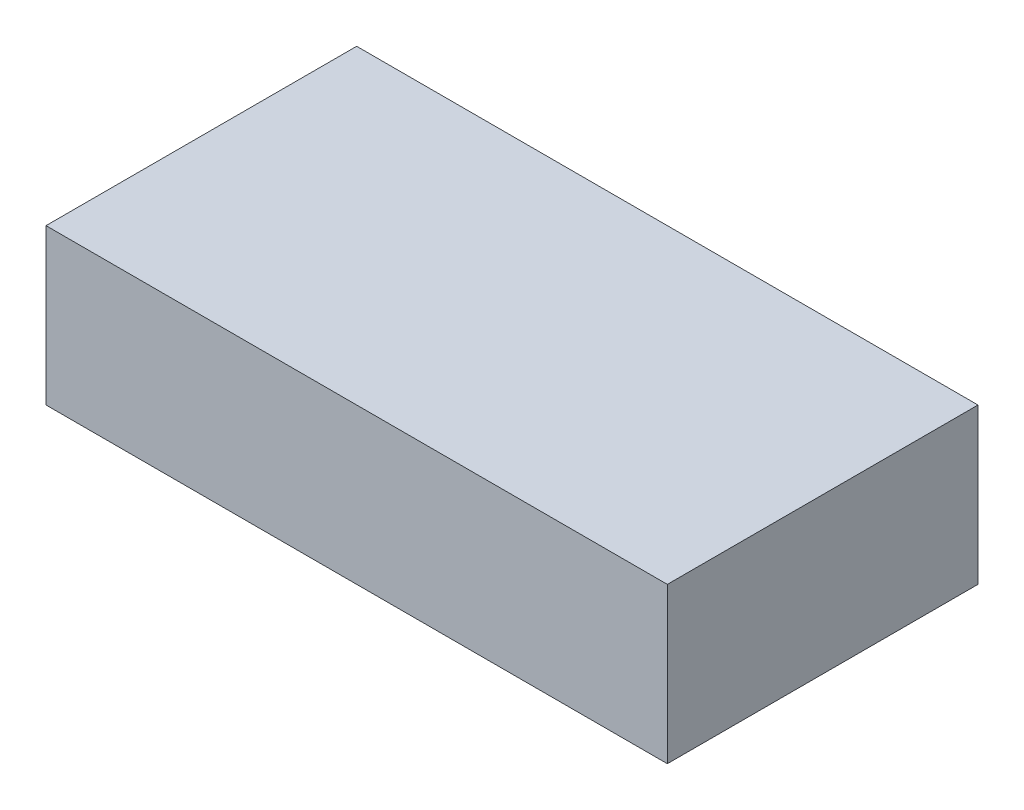
ISO-10303-21;
HEADER;
FILE_DESCRIPTION(('STEP AP214'),'2;1');
FILE_NAME('part.step','',(''),(''),'','','');
FILE_SCHEMA(('AUTOMOTIVE_DESIGN { 1 0 10303 214 1 1 1 1 }'));
ENDSEC;
DATA;
#1=APPLICATION_CONTEXT('core data for automotive mechanical design processes');
#2=APPLICATION_PROTOCOL_DEFINITION('international standard','automotive_design',2000,#1);
#3=PRODUCT_CONTEXT('',#1,'mechanical');
#4=PRODUCT('Part','Part','',(#3));
#5=PRODUCT_RELATED_PRODUCT_CATEGORY('part','',(#4));
#6=PRODUCT_DEFINITION_FORMATION('','',#4);
#7=PRODUCT_DEFINITION_CONTEXT('part definition',#1,'design');
#8=PRODUCT_DEFINITION('design','',#6,#7);
#9=PRODUCT_DEFINITION_SHAPE('','',#8);
#10=(LENGTH_UNIT() NAMED_UNIT(*) SI_UNIT(.MILLI.,.METRE.));
#11=(NAMED_UNIT(*) PLANE_ANGLE_UNIT() SI_UNIT($,.RADIAN.));
#12=(NAMED_UNIT(*) SI_UNIT($,.STERADIAN.) SOLID_ANGLE_UNIT());
#13=UNCERTAINTY_MEASURE_WITH_UNIT(LENGTH_MEASURE(1.E-05),#10,'distance_accuracy_value','');
#14=(GEOMETRIC_REPRESENTATION_CONTEXT(3) GLOBAL_UNCERTAINTY_ASSIGNED_CONTEXT((#13)) GLOBAL_UNIT_ASSIGNED_CONTEXT((#10,
#11,#12)) REPRESENTATION_CONTEXT('',''));
#15=CARTESIAN_POINT('',(0.,0.,0.));
#16=DIRECTION('',(0.,0.,1.));
#17=DIRECTION('',(1.,0.,0.));
#18=AXIS2_PLACEMENT_3D('',#15,#16,#17);
#19=CARTESIAN_POINT('',(0.,0.5,0.));
#20=DIRECTION('',(1.,0.,0.));
#21=DIRECTION('',(0.,0.,-1.));
#22=AXIS2_PLACEMENT_3D('',#19,#20,#21);
#23=PLANE('',#22);
#24=DIRECTION('',(0.,0.,1.));
#25=VECTOR('',#24,1.);
#26=CARTESIAN_POINT('',(0.,0.,0.));
#27=LINE('',#26,#25);
#28=CARTESIAN_POINT('',(0.,0.,-1.));
#29=VERTEX_POINT('',#28);
#30=CARTESIAN_POINT('',(0.,0.,0.));
#31=VERTEX_POINT('',#30);
#32=EDGE_CURVE('E75',#29,#31,#27,.T.);
#33=ORIENTED_EDGE('',*,*,#32,.T.);
#34=DIRECTION('',(0.,-1.,0.));
#35=VECTOR('',#34,1.);
#36=CARTESIAN_POINT('',(0.,0.5,0.));
#37=LINE('',#36,#35);
#38=CARTESIAN_POINT('',(0.,0.5,0.));
#39=VERTEX_POINT('',#38);
#40=EDGE_CURVE('E11',#39,#31,#37,.T.);
#41=ORIENTED_EDGE('',*,*,#40,.F.);
#42=DIRECTION('',(0.,0.,1.));
#43=VECTOR('',#42,1.);
#44=CARTESIAN_POINT('',(0.,0.5,0.));
#45=LINE('',#44,#43);
#46=CARTESIAN_POINT('',(0.,0.5,-1.));
#47=VERTEX_POINT('',#46);
#48=EDGE_CURVE('E93',#47,#39,#45,.T.);
#49=ORIENTED_EDGE('',*,*,#48,.F.);
#50=DIRECTION('',(0.,-1.,0.));
#51=VECTOR('',#50,1.);
#52=CARTESIAN_POINT('',(0.,0.5,-1.));
#53=LINE('',#52,#51);
#54=EDGE_CURVE('E87',#47,#29,#53,.T.);
#55=ORIENTED_EDGE('',*,*,#54,.T.);
#56=EDGE_LOOP('',(#33,#41,#49,#55));
#57=FACE_BOUND('',#56,.T.);
#58=ADVANCED_FACE('F31',(#57),#23,.F.);
#59=CARTESIAN_POINT('',(0.,0.5,0.));
#60=DIRECTION('',(0.,0.,-1.));
#61=DIRECTION('',(-1.,0.,0.));
#62=AXIS2_PLACEMENT_3D('',#59,#60,#61);
#63=PLANE('',#62);
#64=DIRECTION('',(1.,0.,0.));
#65=VECTOR('',#64,1.);
#66=CARTESIAN_POINT('',(0.,0.,0.));
#67=LINE('',#66,#65);
#68=CARTESIAN_POINT('',(2.,0.,0.));
#69=VERTEX_POINT('',#68);
#70=EDGE_CURVE('E71',#31,#69,#67,.T.);
#71=ORIENTED_EDGE('',*,*,#70,.T.);
#72=DIRECTION('',(0.,-1.,0.));
#73=VECTOR('',#72,1.);
#74=CARTESIAN_POINT('',(2.,0.5,0.));
#75=LINE('',#74,#73);
#76=CARTESIAN_POINT('',(2.,0.5,0.));
#77=VERTEX_POINT('',#76);
#78=EDGE_CURVE('E38',#77,#69,#75,.T.);
#79=ORIENTED_EDGE('',*,*,#78,.F.);
#80=DIRECTION('',(1.,0.,0.));
#81=VECTOR('',#80,1.);
#82=CARTESIAN_POINT('',(0.,0.5,0.));
#83=LINE('',#82,#81);
#84=EDGE_CURVE('E83',#39,#77,#83,.T.);
#85=ORIENTED_EDGE('',*,*,#84,.F.);
#86=ORIENTED_EDGE('',*,*,#40,.T.);
#87=EDGE_LOOP('',(#71,#79,#85,#86));
#88=FACE_BOUND('',#87,.T.);
#89=ADVANCED_FACE('F82',(#88),#63,.F.);
#90=CARTESIAN_POINT('',(2.,0.5,0.));
#91=DIRECTION('',(-1.,0.,0.));
#92=DIRECTION('',(0.,0.,1.));
#93=AXIS2_PLACEMENT_3D('',#90,#91,#92);
#94=PLANE('',#93);
#95=DIRECTION('',(0.,0.,-1.));
#96=VECTOR('',#95,1.);
#97=CARTESIAN_POINT('',(2.,0.,0.));
#98=LINE('',#97,#96);
#99=CARTESIAN_POINT('',(2.,0.,-1.));
#100=VERTEX_POINT('',#99);
#101=EDGE_CURVE('E76',#69,#100,#98,.T.);
#102=ORIENTED_EDGE('',*,*,#101,.T.);
#103=DIRECTION('',(0.,-1.,0.));
#104=VECTOR('',#103,1.);
#105=CARTESIAN_POINT('',(2.,0.5,-1.));
#106=LINE('',#105,#104);
#107=CARTESIAN_POINT('',(2.,0.5,-1.));
#108=VERTEX_POINT('',#107);
#109=EDGE_CURVE('E99',#108,#100,#106,.T.);
#110=ORIENTED_EDGE('',*,*,#109,.F.);
#111=DIRECTION('',(0.,0.,-1.));
#112=VECTOR('',#111,1.);
#113=CARTESIAN_POINT('',(2.,0.5,0.));
#114=LINE('',#113,#112);
#115=EDGE_CURVE('E50',#77,#108,#114,.T.);
#116=ORIENTED_EDGE('',*,*,#115,.F.);
#117=ORIENTED_EDGE('',*,*,#78,.T.);
#118=EDGE_LOOP('',(#102,#110,#116,#117));
#119=FACE_BOUND('',#118,.T.);
#120=ADVANCED_FACE('F102',(#119),#94,.F.);
#121=CARTESIAN_POINT('',(0.,0.5,-1.));
#122=DIRECTION('',(0.,0.,1.));
#123=DIRECTION('',(1.,0.,0.));
#124=AXIS2_PLACEMENT_3D('',#121,#122,#123);
#125=PLANE('',#124);
#126=DIRECTION('',(-1.,0.,0.));
#127=VECTOR('',#126,1.);
#128=CARTESIAN_POINT('',(0.,0.,-1.));
#129=LINE('',#128,#127);
#130=EDGE_CURVE('E91',#100,#29,#129,.T.);
#131=ORIENTED_EDGE('',*,*,#130,.T.);
#132=ORIENTED_EDGE('',*,*,#54,.F.);
#133=DIRECTION('',(-1.,0.,0.));
#134=VECTOR('',#133,1.);
#135=CARTESIAN_POINT('',(0.,0.5,-1.));
#136=LINE('',#135,#134);
#137=EDGE_CURVE('E45',#108,#47,#136,.T.);
#138=ORIENTED_EDGE('',*,*,#137,.F.);
#139=ORIENTED_EDGE('',*,*,#109,.T.);
#140=EDGE_LOOP('',(#131,#132,#138,#139));
#141=FACE_BOUND('',#140,.T.);
#142=ADVANCED_FACE('F104',(#141),#125,.F.);
#143=CARTESIAN_POINT('',(0.,0.5,-1.));
#144=DIRECTION('',(0.,-1.,0.));
#145=DIRECTION('',(0.,0.,-1.));
#146=AXIS2_PLACEMENT_3D('',#143,#144,#145);
#147=PLANE('',#146);
#148=ORIENTED_EDGE('',*,*,#48,.T.);
#149=ORIENTED_EDGE('',*,*,#84,.T.);
#150=ORIENTED_EDGE('',*,*,#115,.T.);
#151=ORIENTED_EDGE('',*,*,#137,.T.);
#152=EDGE_LOOP('',(#148,#149,#150,#151));
#153=FACE_BOUND('',#152,.T.);
#154=ADVANCED_FACE('F105',(#153),#147,.F.);
#155=CARTESIAN_POINT('',(0.,0.,-1.));
#156=DIRECTION('',(0.,-1.,0.));
#157=DIRECTION('',(0.,0.,-1.));
#158=AXIS2_PLACEMENT_3D('',#155,#156,#157);
#159=PLANE('',#158);
#160=ORIENTED_EDGE('',*,*,#32,.F.);
#161=ORIENTED_EDGE('',*,*,#130,.F.);
#162=ORIENTED_EDGE('',*,*,#101,.F.);
#163=ORIENTED_EDGE('',*,*,#70,.F.);
#164=EDGE_LOOP('',(#160,#161,#162,#163));
#165=FACE_BOUND('',#164,.T.);
#166=ADVANCED_FACE('F72',(#165),#159,.T.);
#167=CLOSED_SHELL('',(#58,#89,#120,#142,#154,#166));
#168=MANIFOLD_SOLID_BREP('B2',#167);
#169=ADVANCED_BREP_SHAPE_REPRESENTATION('',(#18,#168),#14);
#170=SHAPE_DEFINITION_REPRESENTATION(#9,#169);
ENDSEC;
END-ISO-10303-21;
